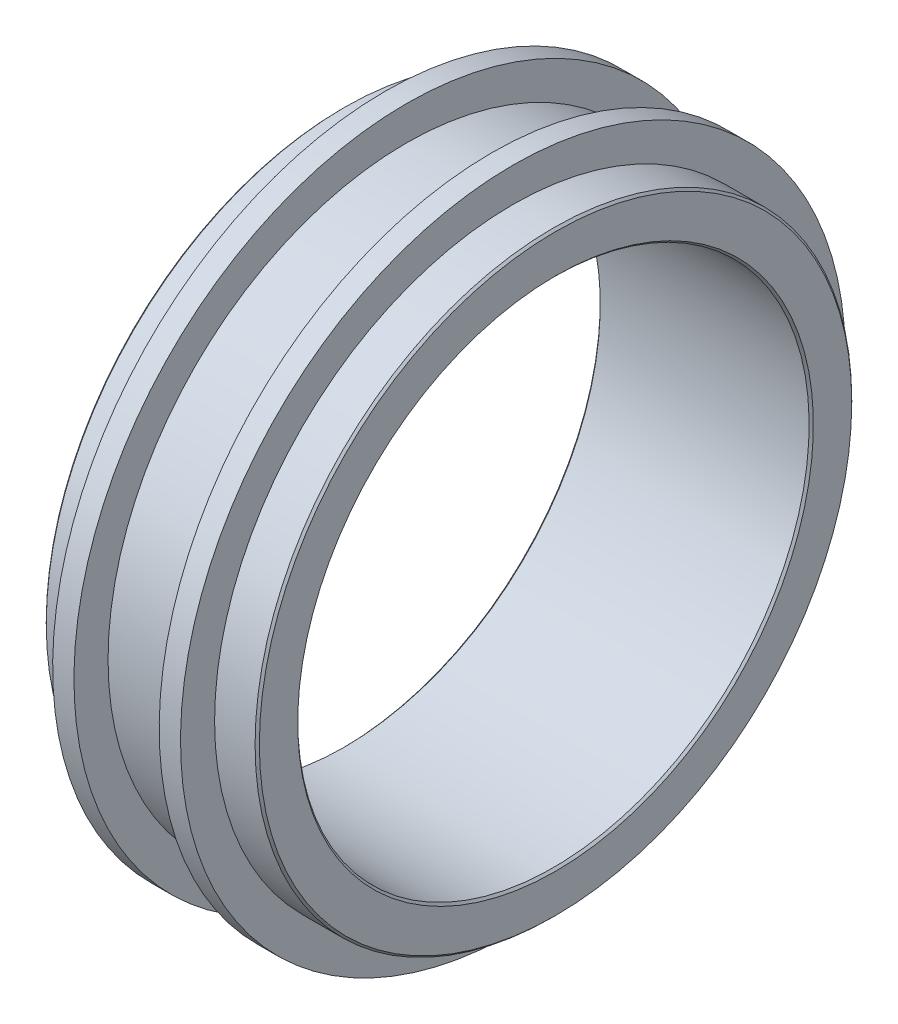
ISO-10303-21;
HEADER;
FILE_DESCRIPTION(('STEP AP214'),'2;1');
FILE_NAME('part.step','',(''),(''),'','','');
FILE_SCHEMA(('AUTOMOTIVE_DESIGN { 1 0 10303 214 1 1 1 1 }'));
ENDSEC;
DATA;
#1=APPLICATION_CONTEXT('core data for automotive mechanical design processes');
#2=APPLICATION_PROTOCOL_DEFINITION('international standard','automotive_design',2000,#1);
#3=PRODUCT_CONTEXT('',#1,'mechanical');
#4=PRODUCT('Part','Part','',(#3));
#5=PRODUCT_RELATED_PRODUCT_CATEGORY('part','',(#4));
#6=PRODUCT_DEFINITION_FORMATION('','',#4);
#7=PRODUCT_DEFINITION_CONTEXT('part definition',#1,'design');
#8=PRODUCT_DEFINITION('design','',#6,#7);
#9=PRODUCT_DEFINITION_SHAPE('','',#8);
#10=(LENGTH_UNIT() NAMED_UNIT(*) SI_UNIT(.MILLI.,.METRE.));
#11=(NAMED_UNIT(*) PLANE_ANGLE_UNIT() SI_UNIT($,.RADIAN.));
#12=(NAMED_UNIT(*) SI_UNIT($,.STERADIAN.) SOLID_ANGLE_UNIT());
#13=UNCERTAINTY_MEASURE_WITH_UNIT(LENGTH_MEASURE(1.E-05),#10,'distance_accuracy_value','');
#14=(GEOMETRIC_REPRESENTATION_CONTEXT(3) GLOBAL_UNCERTAINTY_ASSIGNED_CONTEXT((#13)) GLOBAL_UNIT_ASSIGNED_CONTEXT((#10,
#11,#12)) REPRESENTATION_CONTEXT('',''));
#15=CARTESIAN_POINT('',(0.,0.,0.));
#16=DIRECTION('',(0.,0.,1.));
#17=DIRECTION('',(1.,0.,0.));
#18=AXIS2_PLACEMENT_3D('',#15,#16,#17);
#19=CARTESIAN_POINT('',(-4.43661971830986,7.,0.));
#20=DIRECTION('',(-1.,0.,0.));
#21=DIRECTION('',(0.,-1.,0.));
#22=AXIS2_PLACEMENT_3D('',#19,#20,#21);
#23=PLANE('',#22);
#24=CARTESIAN_POINT('',(-4.43661971830986,0.,0.));
#25=DIRECTION('',(-1.,0.,0.));
#26=DIRECTION('',(0.,-1.,0.));
#27=AXIS2_PLACEMENT_3D('',#24,#25,#26);
#28=CIRCLE('',#27,6.95);
#29=CARTESIAN_POINT('',(-4.43661971830986,-6.95,0.));
#30=VERTEX_POINT('',#29);
#31=EDGE_CURVE('E56',#30,#30,#28,.T.);
#32=ORIENTED_EDGE('',*,*,#31,.T.);
#33=EDGE_LOOP('',(#32));
#34=FACE_BOUND('',#33,.T.);
#35=CARTESIAN_POINT('',(-4.43661971830986,0.,0.));
#36=DIRECTION('',(-1.,0.,0.));
#37=DIRECTION('',(0.,-1.,0.));
#38=AXIS2_PLACEMENT_3D('',#35,#36,#37);
#39=CIRCLE('',#38,6.05);
#40=CARTESIAN_POINT('',(-4.43661971830986,-6.05,0.));
#41=VERTEX_POINT('',#40);
#42=EDGE_CURVE('E59',#41,#41,#39,.F.);
#43=ORIENTED_EDGE('',*,*,#42,.T.);
#44=EDGE_LOOP('',(#43));
#45=FACE_BOUND('',#44,.T.);
#46=ADVANCED_FACE('F33',(#34,#45),#23,.T.);
#47=CARTESIAN_POINT('',(0.,0.,0.));
#48=DIRECTION('',(1.,0.,0.));
#49=DIRECTION('',(0.,1.,0.));
#50=AXIS2_PLACEMENT_3D('',#47,#48,#49);
#51=CYLINDRICAL_SURFACE('',#50,6.);
#52=CARTESIAN_POINT('',(-4.38661971830986,0.,0.));
#53=DIRECTION('',(-1.,0.,0.));
#54=DIRECTION('',(0.,-1.,0.));
#55=AXIS2_PLACEMENT_3D('',#52,#53,#54);
#56=CIRCLE('',#55,6.);
#57=CARTESIAN_POINT('',(-4.38661971830986,-6.,0.));
#58=VERTEX_POINT('',#57);
#59=EDGE_CURVE('E48',#58,#58,#56,.T.);
#60=ORIENTED_EDGE('',*,*,#59,.T.);
#61=EDGE_LOOP('',(#60));
#62=FACE_BOUND('',#61,.T.);
#63=CARTESIAN_POINT('',(0.513380281690137,0.,0.));
#64=DIRECTION('',(1.,0.,0.));
#65=DIRECTION('',(0.,1.,0.));
#66=AXIS2_PLACEMENT_3D('',#63,#64,#65);
#67=CIRCLE('',#66,6.);
#68=CARTESIAN_POINT('',(0.513380281690137,6.,0.));
#69=VERTEX_POINT('',#68);
#70=EDGE_CURVE('E53',#69,#69,#67,.T.);
#71=ORIENTED_EDGE('',*,*,#70,.T.);
#72=EDGE_LOOP('',(#71));
#73=FACE_BOUND('',#72,.T.);
#74=ADVANCED_FACE('F108',(#62,#73),#51,.F.);
#75=CARTESIAN_POINT('',(0.563380281690138,6.,0.));
#76=DIRECTION('',(1.,0.,0.));
#77=DIRECTION('',(0.,1.,0.));
#78=AXIS2_PLACEMENT_3D('',#75,#76,#77);
#79=PLANE('',#78);
#80=CARTESIAN_POINT('',(0.563380281690139,0.,0.));
#81=DIRECTION('',(1.,0.,0.));
#82=DIRECTION('',(0.,1.,0.));
#83=AXIS2_PLACEMENT_3D('',#80,#81,#82);
#84=CIRCLE('',#83,6.05);
#85=CARTESIAN_POINT('',(0.563380281690138,6.05,0.));
#86=VERTEX_POINT('',#85);
#87=EDGE_CURVE('E40',#86,#86,#84,.F.);
#88=ORIENTED_EDGE('',*,*,#87,.T.);
#89=EDGE_LOOP('',(#88));
#90=FACE_BOUND('',#89,.T.);
#91=CARTESIAN_POINT('',(0.563380281690139,0.,0.));
#92=DIRECTION('',(1.,0.,0.));
#93=DIRECTION('',(0.,1.,0.));
#94=AXIS2_PLACEMENT_3D('',#91,#92,#93);
#95=CIRCLE('',#94,6.95);
#96=CARTESIAN_POINT('',(0.563380281690138,6.95,0.));
#97=VERTEX_POINT('',#96);
#98=EDGE_CURVE('E44',#97,#97,#95,.T.);
#99=ORIENTED_EDGE('',*,*,#98,.T.);
#100=EDGE_LOOP('',(#99));
#101=FACE_BOUND('',#100,.T.);
#102=ADVANCED_FACE('F114',(#90,#101),#79,.T.);
#103=CARTESIAN_POINT('',(0.,0.,0.));
#104=DIRECTION('',(1.,0.,0.));
#105=DIRECTION('',(0.,1.,0.));
#106=AXIS2_PLACEMENT_3D('',#103,#104,#105);
#107=CYLINDRICAL_SURFACE('',#106,7.);
#108=CARTESIAN_POINT('',(0.513380281690143,0.,0.));
#109=DIRECTION('',(1.,0.,0.));
#110=DIRECTION('',(0.,1.,0.));
#111=AXIS2_PLACEMENT_3D('',#108,#109,#110);
#112=CIRCLE('',#111,7.);
#113=CARTESIAN_POINT('',(0.513380281690142,7.,0.));
#114=VERTEX_POINT('',#113);
#115=EDGE_CURVE('E10',#114,#114,#112,.F.);
#116=ORIENTED_EDGE('',*,*,#115,.T.);
#117=EDGE_LOOP('',(#116));
#118=FACE_BOUND('',#117,.T.);
#119=CARTESIAN_POINT('',(-0.436619718309861,0.,0.));
#120=DIRECTION('',(1.,0.,0.));
#121=DIRECTION('',(0.,1.,0.));
#122=AXIS2_PLACEMENT_3D('',#119,#120,#121);
#123=CIRCLE('',#122,7.);
#124=CARTESIAN_POINT('',(-0.436619718309862,7.,0.));
#125=VERTEX_POINT('',#124);
#126=EDGE_CURVE('E65',#125,#125,#123,.T.);
#127=ORIENTED_EDGE('',*,*,#126,.T.);
#128=EDGE_LOOP('',(#127));
#129=FACE_BOUND('',#128,.T.);
#130=ADVANCED_FACE('F138',(#118,#129),#107,.T.);
#131=CARTESIAN_POINT('',(-0.436619718309862,7.,0.));
#132=DIRECTION('',(1.,0.,0.));
#133=DIRECTION('',(0.,1.,0.));
#134=AXIS2_PLACEMENT_3D('',#131,#132,#133);
#135=PLANE('',#134);
#136=CARTESIAN_POINT('',(-0.436619718309861,0.,0.));
#137=DIRECTION('',(1.,0.,0.));
#138=DIRECTION('',(0.,1.,0.));
#139=AXIS2_PLACEMENT_3D('',#136,#137,#138);
#140=CIRCLE('',#139,7.8);
#141=CARTESIAN_POINT('',(-0.436619718309862,7.8,0.));
#142=VERTEX_POINT('',#141);
#143=EDGE_CURVE('E68',#142,#142,#140,.T.);
#144=ORIENTED_EDGE('',*,*,#143,.T.);
#145=EDGE_LOOP('',(#144));
#146=FACE_BOUND('',#145,.T.);
#147=ORIENTED_EDGE('',*,*,#126,.F.);
#148=EDGE_LOOP('',(#147));
#149=FACE_BOUND('',#148,.T.);
#150=ADVANCED_FACE('F142',(#146,#149),#135,.T.);
#151=CARTESIAN_POINT('',(0.,0.,0.));
#152=DIRECTION('',(1.,0.,0.));
#153=DIRECTION('',(0.,1.,0.));
#154=AXIS2_PLACEMENT_3D('',#151,#152,#153);
#155=CYLINDRICAL_SURFACE('',#154,7.8);
#156=CARTESIAN_POINT('',(-0.936619718309861,0.,0.));
#157=DIRECTION('',(1.,0.,0.));
#158=DIRECTION('',(0.,1.,0.));
#159=AXIS2_PLACEMENT_3D('',#156,#157,#158);
#160=CIRCLE('',#159,7.8);
#161=CARTESIAN_POINT('',(-0.936619718309862,7.8,0.));
#162=VERTEX_POINT('',#161);
#163=EDGE_CURVE('E71',#162,#162,#160,.T.);
#164=ORIENTED_EDGE('',*,*,#163,.T.);
#165=EDGE_LOOP('',(#164));
#166=FACE_BOUND('',#165,.T.);
#167=ORIENTED_EDGE('',*,*,#143,.F.);
#168=EDGE_LOOP('',(#167));
#169=FACE_BOUND('',#168,.T.);
#170=ADVANCED_FACE('F147',(#166,#169),#155,.T.);
#171=CARTESIAN_POINT('',(-0.936619718309862,7.8,0.));
#172=DIRECTION('',(-1.,0.,0.));
#173=DIRECTION('',(0.,-1.,0.));
#174=AXIS2_PLACEMENT_3D('',#171,#172,#173);
#175=PLANE('',#174);
#176=CARTESIAN_POINT('',(-0.936619718309861,0.,0.));
#177=DIRECTION('',(1.,0.,0.));
#178=DIRECTION('',(0.,1.,0.));
#179=AXIS2_PLACEMENT_3D('',#176,#177,#178);
#180=CIRCLE('',#179,7.);
#181=CARTESIAN_POINT('',(-0.936619718309862,7.,0.));
#182=VERTEX_POINT('',#181);
#183=EDGE_CURVE('E74',#182,#182,#180,.T.);
#184=ORIENTED_EDGE('',*,*,#183,.T.);
#185=EDGE_LOOP('',(#184));
#186=FACE_BOUND('',#185,.T.);
#187=ORIENTED_EDGE('',*,*,#163,.F.);
#188=EDGE_LOOP('',(#187));
#189=FACE_BOUND('',#188,.T.);
#190=ADVANCED_FACE('F151',(#186,#189),#175,.T.);
#191=CARTESIAN_POINT('',(0.,0.,0.));
#192=DIRECTION('',(1.,0.,0.));
#193=DIRECTION('',(0.,1.,0.));
#194=AXIS2_PLACEMENT_3D('',#191,#192,#193);
#195=CYLINDRICAL_SURFACE('',#194,7.);
#196=CARTESIAN_POINT('',(-2.93661971830986,0.,0.));
#197=DIRECTION('',(1.,0.,0.));
#198=DIRECTION('',(0.,1.,0.));
#199=AXIS2_PLACEMENT_3D('',#196,#197,#198);
#200=CIRCLE('',#199,7.);
#201=CARTESIAN_POINT('',(-2.93661971830986,7.,0.));
#202=VERTEX_POINT('',#201);
#203=EDGE_CURVE('E77',#202,#202,#200,.T.);
#204=ORIENTED_EDGE('',*,*,#203,.T.);
#205=EDGE_LOOP('',(#204));
#206=FACE_BOUND('',#205,.T.);
#207=ORIENTED_EDGE('',*,*,#183,.F.);
#208=EDGE_LOOP('',(#207));
#209=FACE_BOUND('',#208,.T.);
#210=ADVANCED_FACE('F155',(#206,#209),#195,.T.);
#211=CARTESIAN_POINT('',(-2.93661971830986,7.,0.));
#212=DIRECTION('',(1.,0.,0.));
#213=DIRECTION('',(0.,1.,0.));
#214=AXIS2_PLACEMENT_3D('',#211,#212,#213);
#215=PLANE('',#214);
#216=CARTESIAN_POINT('',(-2.93661971830986,0.,0.));
#217=DIRECTION('',(1.,0.,0.));
#218=DIRECTION('',(0.,1.,0.));
#219=AXIS2_PLACEMENT_3D('',#216,#217,#218);
#220=CIRCLE('',#219,7.8);
#221=CARTESIAN_POINT('',(-2.93661971830986,7.8,0.));
#222=VERTEX_POINT('',#221);
#223=EDGE_CURVE('E80',#222,#222,#220,.T.);
#224=ORIENTED_EDGE('',*,*,#223,.T.);
#225=EDGE_LOOP('',(#224));
#226=FACE_BOUND('',#225,.T.);
#227=ORIENTED_EDGE('',*,*,#203,.F.);
#228=EDGE_LOOP('',(#227));
#229=FACE_BOUND('',#228,.T.);
#230=ADVANCED_FACE('F159',(#226,#229),#215,.T.);
#231=CARTESIAN_POINT('',(0.,0.,0.));
#232=DIRECTION('',(1.,0.,0.));
#233=DIRECTION('',(0.,1.,0.));
#234=AXIS2_PLACEMENT_3D('',#231,#232,#233);
#235=CYLINDRICAL_SURFACE('',#234,7.8);
#236=CARTESIAN_POINT('',(-3.43661971830986,0.,0.));
#237=DIRECTION('',(1.,0.,0.));
#238=DIRECTION('',(0.,1.,0.));
#239=AXIS2_PLACEMENT_3D('',#236,#237,#238);
#240=CIRCLE('',#239,7.8);
#241=CARTESIAN_POINT('',(-3.43661971830986,7.8,0.));
#242=VERTEX_POINT('',#241);
#243=EDGE_CURVE('E83',#242,#242,#240,.T.);
#244=ORIENTED_EDGE('',*,*,#243,.T.);
#245=EDGE_LOOP('',(#244));
#246=FACE_BOUND('',#245,.T.);
#247=ORIENTED_EDGE('',*,*,#223,.F.);
#248=EDGE_LOOP('',(#247));
#249=FACE_BOUND('',#248,.T.);
#250=ADVANCED_FACE('F105',(#246,#249),#235,.T.);
#251=CARTESIAN_POINT('',(-3.43661971830986,7.8,0.));
#252=DIRECTION('',(-1.,0.,0.));
#253=DIRECTION('',(0.,-1.,0.));
#254=AXIS2_PLACEMENT_3D('',#251,#252,#253);
#255=PLANE('',#254);
#256=CARTESIAN_POINT('',(-3.43661971830986,0.,0.));
#257=DIRECTION('',(1.,0.,0.));
#258=DIRECTION('',(0.,1.,0.));
#259=AXIS2_PLACEMENT_3D('',#256,#257,#258);
#260=CIRCLE('',#259,7.);
#261=CARTESIAN_POINT('',(-3.43661971830986,7.,0.));
#262=VERTEX_POINT('',#261);
#263=EDGE_CURVE('E86',#262,#262,#260,.T.);
#264=ORIENTED_EDGE('',*,*,#263,.T.);
#265=EDGE_LOOP('',(#264));
#266=FACE_BOUND('',#265,.T.);
#267=ORIENTED_EDGE('',*,*,#243,.F.);
#268=EDGE_LOOP('',(#267));
#269=FACE_BOUND('',#268,.T.);
#270=ADVANCED_FACE('F90',(#266,#269),#255,.T.);
#271=CARTESIAN_POINT('',(0.,0.,0.));
#272=DIRECTION('',(1.,0.,0.));
#273=DIRECTION('',(0.,1.,0.));
#274=AXIS2_PLACEMENT_3D('',#271,#272,#273);
#275=CYLINDRICAL_SURFACE('',#274,7.);
#276=CARTESIAN_POINT('',(-4.38661971830986,0.,0.));
#277=DIRECTION('',(-1.,0.,0.));
#278=DIRECTION('',(0.,-1.,0.));
#279=AXIS2_PLACEMENT_3D('',#276,#277,#278);
#280=CIRCLE('',#279,7.);
#281=CARTESIAN_POINT('',(-4.38661971830986,-7.,0.));
#282=VERTEX_POINT('',#281);
#283=EDGE_CURVE('E62',#282,#282,#280,.F.);
#284=ORIENTED_EDGE('',*,*,#283,.T.);
#285=EDGE_LOOP('',(#284));
#286=FACE_BOUND('',#285,.T.);
#287=ORIENTED_EDGE('',*,*,#263,.F.);
#288=EDGE_LOOP('',(#287));
#289=FACE_BOUND('',#288,.T.);
#290=ADVANCED_FACE('F93',(#286,#289),#275,.T.);
#291=CARTESIAN_POINT('',(-4.38661971830986,0.,0.));
#292=DIRECTION('',(1.,0.,0.));
#293=DIRECTION('',(0.,1.,0.));
#294=AXIS2_PLACEMENT_3D('',#291,#292,#293);
#295=CONICAL_SURFACE('',#294,7.,0.78539816339744);
#296=ORIENTED_EDGE('',*,*,#31,.F.);
#297=EDGE_LOOP('',(#296));
#298=FACE_BOUND('',#297,.T.);
#299=ORIENTED_EDGE('',*,*,#283,.F.);
#300=EDGE_LOOP('',(#299));
#301=FACE_BOUND('',#300,.T.);
#302=ADVANCED_FACE('F95',(#298,#301),#295,.T.);
#303=CARTESIAN_POINT('',(-4.43661971830986,0.,0.));
#304=DIRECTION('',(-1.,0.,0.));
#305=DIRECTION('',(0.,-1.,0.));
#306=AXIS2_PLACEMENT_3D('',#303,#304,#305);
#307=CONICAL_SURFACE('',#306,6.05,0.785398163397457);
#308=ORIENTED_EDGE('',*,*,#59,.F.);
#309=EDGE_LOOP('',(#308));
#310=FACE_BOUND('',#309,.T.);
#311=ORIENTED_EDGE('',*,*,#42,.F.);
#312=EDGE_LOOP('',(#311));
#313=FACE_BOUND('',#312,.T.);
#314=ADVANCED_FACE('F102',(#310,#313),#307,.F.);
#315=CARTESIAN_POINT('',(0.513380281690137,0.,0.));
#316=DIRECTION('',(1.,0.,0.));
#317=DIRECTION('',(0.,1.,0.));
#318=AXIS2_PLACEMENT_3D('',#315,#316,#317);
#319=CONICAL_SURFACE('',#318,6.,0.785398163397474);
#320=ORIENTED_EDGE('',*,*,#87,.F.);
#321=EDGE_LOOP('',(#320));
#322=FACE_BOUND('',#321,.T.);
#323=ORIENTED_EDGE('',*,*,#70,.F.);
#324=EDGE_LOOP('',(#323));
#325=FACE_BOUND('',#324,.T.);
#326=ADVANCED_FACE('F121',(#322,#325),#319,.F.);
#327=CARTESIAN_POINT('',(0.563380281690139,0.,0.));
#328=DIRECTION('',(-1.,0.,0.));
#329=DIRECTION('',(0.,-1.,0.));
#330=AXIS2_PLACEMENT_3D('',#327,#328,#329);
#331=CONICAL_SURFACE('',#330,6.95,0.785398163397448);
#332=ORIENTED_EDGE('',*,*,#115,.F.);
#333=EDGE_LOOP('',(#332));
#334=FACE_BOUND('',#333,.T.);
#335=ORIENTED_EDGE('',*,*,#98,.F.);
#336=EDGE_LOOP('',(#335));
#337=FACE_BOUND('',#336,.T.);
#338=ADVANCED_FACE('F35',(#334,#337),#331,.T.);
#339=CLOSED_SHELL('',(#46,#74,#102,#130,#150,#170,#190,#210,#230,#250,#270,#290,#302,#314,#326,#338));
#340=MANIFOLD_SOLID_BREP('B2',#339);
#341=ADVANCED_BREP_SHAPE_REPRESENTATION('',(#18,#340),#14);
#342=SHAPE_DEFINITION_REPRESENTATION(#9,#341);
ENDSEC;
END-ISO-10303-21;
